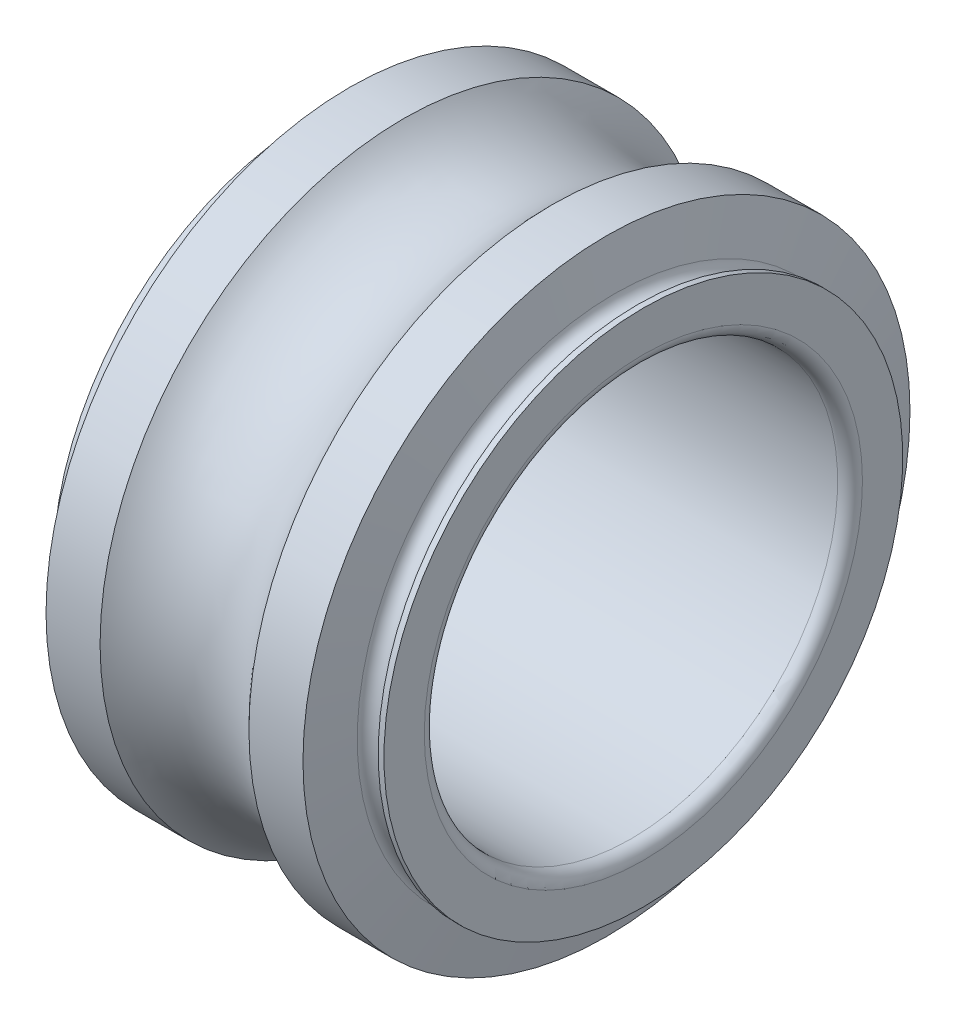
ISO-10303-21;
HEADER;
FILE_DESCRIPTION(('STEP AP214'),'2;1');
FILE_NAME('part.step','',(''),(''),'','','');
FILE_SCHEMA(('AUTOMOTIVE_DESIGN { 1 0 10303 214 1 1 1 1 }'));
ENDSEC;
DATA;
#1=APPLICATION_CONTEXT('core data for automotive mechanical design processes');
#2=APPLICATION_PROTOCOL_DEFINITION('international standard','automotive_design',2000,#1);
#3=PRODUCT_CONTEXT('',#1,'mechanical');
#4=PRODUCT('Part','Part','',(#3));
#5=PRODUCT_RELATED_PRODUCT_CATEGORY('part','',(#4));
#6=PRODUCT_DEFINITION_FORMATION('','',#4);
#7=PRODUCT_DEFINITION_CONTEXT('part definition',#1,'design');
#8=PRODUCT_DEFINITION('design','',#6,#7);
#9=PRODUCT_DEFINITION_SHAPE('','',#8);
#10=(LENGTH_UNIT() NAMED_UNIT(*) SI_UNIT(.MILLI.,.METRE.));
#11=(NAMED_UNIT(*) PLANE_ANGLE_UNIT() SI_UNIT($,.RADIAN.));
#12=(NAMED_UNIT(*) SI_UNIT($,.STERADIAN.) SOLID_ANGLE_UNIT());
#13=UNCERTAINTY_MEASURE_WITH_UNIT(LENGTH_MEASURE(1.E-05),#10,'distance_accuracy_value','');
#14=(GEOMETRIC_REPRESENTATION_CONTEXT(3) GLOBAL_UNCERTAINTY_ASSIGNED_CONTEXT((#13)) GLOBAL_UNIT_ASSIGNED_CONTEXT((#10,
#11,#12)) REPRESENTATION_CONTEXT('',''));
#15=CARTESIAN_POINT('',(0.,0.,0.));
#16=DIRECTION('',(0.,0.,1.));
#17=DIRECTION('',(1.,0.,0.));
#18=AXIS2_PLACEMENT_3D('',#15,#16,#17);
#19=CARTESIAN_POINT('',(6.45393324010605,0.,0.));
#20=DIRECTION('',(-1.,0.,0.));
#21=DIRECTION('',(0.,1.,0.));
#22=AXIS2_PLACEMENT_3D('',#19,#20,#21);
#23=CYLINDRICAL_SURFACE('',#22,7.34175);
#24=CARTESIAN_POINT('',(5.80028273821086,0.,0.));
#25=DIRECTION('',(1.,0.,0.));
#26=DIRECTION('',(0.,1.,0.));
#27=AXIS2_PLACEMENT_3D('',#24,#25,#26);
#28=CIRCLE('',#27,7.34175);
#29=CARTESIAN_POINT('',(5.80028273821086,7.34175,0.));
#30=VERTEX_POINT('',#29);
#31=EDGE_CURVE('E11',#30,#30,#28,.T.);
#32=ORIENTED_EDGE('',*,*,#31,.T.);
#33=EDGE_LOOP('',(#32));
#34=FACE_BOUND('',#33,.T.);
#35=CARTESIAN_POINT('',(7.10758374200124,0.,0.));
#36=DIRECTION('',(1.,0.,0.));
#37=DIRECTION('',(0.,1.,0.));
#38=AXIS2_PLACEMENT_3D('',#35,#36,#37);
#39=CIRCLE('',#38,7.34175);
#40=CARTESIAN_POINT('',(7.10758374200124,7.34175,0.));
#41=VERTEX_POINT('',#40);
#42=EDGE_CURVE('E99',#41,#41,#39,.T.);
#43=ORIENTED_EDGE('',*,*,#42,.F.);
#44=EDGE_LOOP('',(#43));
#45=FACE_BOUND('',#44,.T.);
#46=ADVANCED_FACE('F16',(#34,#45),#23,.T.);
#47=CARTESIAN_POINT('',(4.,0.,0.));
#48=DIRECTION('',(1.,0.,0.));
#49=DIRECTION('',(0.,0.,-1.));
#50=AXIS2_PLACEMENT_3D('',#47,#48,#49);
#51=TOROIDAL_SURFACE('',#50,8.9,2.381);
#52=CARTESIAN_POINT('',(2.19971726178914,0.,0.));
#53=DIRECTION('',(1.,0.,0.));
#54=DIRECTION('',(0.,1.,0.));
#55=AXIS2_PLACEMENT_3D('',#52,#53,#54);
#56=CIRCLE('',#55,7.34175);
#57=CARTESIAN_POINT('',(2.19971726178914,7.34175,0.));
#58=VERTEX_POINT('',#57);
#59=EDGE_CURVE('E26',#58,#58,#56,.T.);
#60=ORIENTED_EDGE('',*,*,#59,.T.);
#61=EDGE_LOOP('',(#60));
#62=FACE_BOUND('',#61,.T.);
#63=ORIENTED_EDGE('',*,*,#31,.F.);
#64=EDGE_LOOP('',(#63));
#65=FACE_BOUND('',#64,.T.);
#66=ADVANCED_FACE('F108',(#62,#65),#51,.F.);
#67=CARTESIAN_POINT('',(1.54606675989395,0.,0.));
#68=DIRECTION('',(-1.,0.,0.));
#69=DIRECTION('',(0.,1.,0.));
#70=AXIS2_PLACEMENT_3D('',#67,#68,#69);
#71=CYLINDRICAL_SURFACE('',#70,7.34175);
#72=CARTESIAN_POINT('',(0.892416257998765,0.,0.));
#73=DIRECTION('',(1.,0.,0.));
#74=DIRECTION('',(0.,1.,0.));
#75=AXIS2_PLACEMENT_3D('',#72,#73,#74);
#76=CIRCLE('',#75,7.34175);
#77=CARTESIAN_POINT('',(0.892416257998765,7.34175,0.));
#78=VERTEX_POINT('',#77);
#79=EDGE_CURVE('E46',#78,#78,#76,.T.);
#80=ORIENTED_EDGE('',*,*,#79,.T.);
#81=EDGE_LOOP('',(#80));
#82=FACE_BOUND('',#81,.T.);
#83=ORIENTED_EDGE('',*,*,#59,.F.);
#84=EDGE_LOOP('',(#83));
#85=FACE_BOUND('',#84,.T.);
#86=ADVANCED_FACE('F114',(#82,#85),#71,.T.);
#87=CARTESIAN_POINT('',(0.794081214421092,0.,0.));
#88=DIRECTION('',(1.,0.,0.));
#89=DIRECTION('',(0.,1.,0.));
#90=AXIS2_PLACEMENT_3D('',#87,#88,#89);
#91=CONICAL_SURFACE('',#90,6.78406425512663,1.39626340159546);
#92=CARTESIAN_POINT('',(0.695746170843419,0.,0.));
#93=DIRECTION('',(1.,0.,0.));
#94=DIRECTION('',(0.,1.,0.));
#95=AXIS2_PLACEMENT_3D('',#92,#93,#94);
#96=CIRCLE('',#95,6.22637851025326);
#97=CARTESIAN_POINT('',(0.695746170843419,6.22637851025326,0.));
#98=VERTEX_POINT('',#97);
#99=EDGE_CURVE('E50',#98,#98,#96,.T.);
#100=ORIENTED_EDGE('',*,*,#99,.T.);
#101=EDGE_LOOP('',(#100));
#102=FACE_BOUND('',#101,.T.);
#103=ORIENTED_EDGE('',*,*,#79,.F.);
#104=EDGE_LOOP('',(#103));
#105=FACE_BOUND('',#104,.T.);
#106=ADVANCED_FACE('F125',(#102,#105),#91,.T.);
#107=CARTESIAN_POINT('',(0.42,0.,0.));
#108=DIRECTION('',(1.,0.,0.));
#109=DIRECTION('',(0.,0.,-1.));
#110=AXIS2_PLACEMENT_3D('',#107,#108,#109);
#111=TOROIDAL_SURFACE('',#110,6.275,0.28);
#112=CARTESIAN_POINT('',(0.14,0.,0.));
#113=DIRECTION('',(1.,0.,0.));
#114=DIRECTION('',(0.,1.,0.));
#115=AXIS2_PLACEMENT_3D('',#112,#113,#114);
#116=CIRCLE('',#115,6.275);
#117=CARTESIAN_POINT('',(0.14,6.275,0.));
#118=VERTEX_POINT('',#117);
#119=EDGE_CURVE('E90',#118,#118,#116,.T.);
#120=ORIENTED_EDGE('',*,*,#119,.T.);
#121=EDGE_LOOP('',(#120));
#122=FACE_BOUND('',#121,.T.);
#123=ORIENTED_EDGE('',*,*,#99,.F.);
#124=EDGE_LOOP('',(#123));
#125=FACE_BOUND('',#124,.T.);
#126=ADVANCED_FACE('F18',(#122,#125),#111,.F.);
#127=CARTESIAN_POINT('',(0.07,0.,0.));
#128=DIRECTION('',(-1.,0.,0.));
#129=DIRECTION('',(0.,1.,0.));
#130=AXIS2_PLACEMENT_3D('',#127,#128,#129);
#131=CYLINDRICAL_SURFACE('',#130,6.275);
#132=CARTESIAN_POINT('',(0.,0.,0.));
#133=DIRECTION('',(1.,0.,0.));
#134=DIRECTION('',(0.,1.,0.));
#135=AXIS2_PLACEMENT_3D('',#132,#133,#134);
#136=CIRCLE('',#135,6.275);
#137=CARTESIAN_POINT('',(0.,6.275,0.));
#138=VERTEX_POINT('',#137);
#139=EDGE_CURVE('E20',#138,#138,#136,.T.);
#140=ORIENTED_EDGE('',*,*,#139,.T.);
#141=EDGE_LOOP('',(#140));
#142=FACE_BOUND('',#141,.T.);
#143=ORIENTED_EDGE('',*,*,#119,.F.);
#144=EDGE_LOOP('',(#143));
#145=FACE_BOUND('',#144,.T.);
#146=ADVANCED_FACE('F118',(#142,#145),#131,.T.);
#147=CARTESIAN_POINT('',(0.,5.7875,0.));
#148=DIRECTION('',(-1.,0.,0.));
#149=DIRECTION('',(0.,-1.,0.));
#150=AXIS2_PLACEMENT_3D('',#147,#148,#149);
#151=PLANE('',#150);
#152=CARTESIAN_POINT('',(0.,0.,0.));
#153=DIRECTION('',(1.,0.,0.));
#154=DIRECTION('',(0.,1.,0.));
#155=AXIS2_PLACEMENT_3D('',#152,#153,#154);
#156=CIRCLE('',#155,5.3);
#157=CARTESIAN_POINT('',(0.,5.3,0.));
#158=VERTEX_POINT('',#157);
#159=EDGE_CURVE('E84',#158,#158,#156,.T.);
#160=ORIENTED_EDGE('',*,*,#159,.T.);
#161=EDGE_LOOP('',(#160));
#162=FACE_BOUND('',#161,.T.);
#163=ORIENTED_EDGE('',*,*,#139,.F.);
#164=EDGE_LOOP('',(#163));
#165=FACE_BOUND('',#164,.T.);
#166=ADVANCED_FACE('F139',(#162,#165),#151,.T.);
#167=CARTESIAN_POINT('',(0.3,0.,0.));
#168=DIRECTION('',(1.,0.,0.));
#169=DIRECTION('',(0.,0.,-1.));
#170=AXIS2_PLACEMENT_3D('',#167,#168,#169);
#171=TOROIDAL_SURFACE('',#170,5.3,0.3);
#172=CARTESIAN_POINT('',(0.3,0.,0.));
#173=DIRECTION('',(1.,0.,0.));
#174=DIRECTION('',(0.,1.,0.));
#175=AXIS2_PLACEMENT_3D('',#172,#173,#174);
#176=CIRCLE('',#175,5.);
#177=CARTESIAN_POINT('',(0.3,5.,0.));
#178=VERTEX_POINT('',#177);
#179=EDGE_CURVE('E82',#178,#178,#176,.T.);
#180=ORIENTED_EDGE('',*,*,#179,.T.);
#181=EDGE_LOOP('',(#180));
#182=FACE_BOUND('',#181,.T.);
#183=ORIENTED_EDGE('',*,*,#159,.F.);
#184=EDGE_LOOP('',(#183));
#185=FACE_BOUND('',#184,.T.);
#186=ADVANCED_FACE('F145',(#182,#185),#171,.T.);
#187=CARTESIAN_POINT('',(4.,0.,0.));
#188=DIRECTION('',(-1.,0.,0.));
#189=DIRECTION('',(0.,1.,0.));
#190=AXIS2_PLACEMENT_3D('',#187,#188,#189);
#191=CYLINDRICAL_SURFACE('',#190,5.);
#192=CARTESIAN_POINT('',(7.7,0.,0.));
#193=DIRECTION('',(1.,0.,0.));
#194=DIRECTION('',(0.,1.,0.));
#195=AXIS2_PLACEMENT_3D('',#192,#193,#194);
#196=CIRCLE('',#195,5.);
#197=CARTESIAN_POINT('',(7.7,5.,0.));
#198=VERTEX_POINT('',#197);
#199=EDGE_CURVE('E78',#198,#198,#196,.T.);
#200=ORIENTED_EDGE('',*,*,#199,.T.);
#201=EDGE_LOOP('',(#200));
#202=FACE_BOUND('',#201,.T.);
#203=ORIENTED_EDGE('',*,*,#179,.F.);
#204=EDGE_LOOP('',(#203));
#205=FACE_BOUND('',#204,.T.);
#206=ADVANCED_FACE('F79',(#202,#205),#191,.F.);
#207=CARTESIAN_POINT('',(7.7,0.,0.));
#208=DIRECTION('',(1.,0.,0.));
#209=DIRECTION('',(0.,0.,-1.));
#210=AXIS2_PLACEMENT_3D('',#207,#208,#209);
#211=TOROIDAL_SURFACE('',#210,5.3,0.3);
#212=CARTESIAN_POINT('',(8.,0.,0.));
#213=DIRECTION('',(1.,0.,0.));
#214=DIRECTION('',(0.,1.,0.));
#215=AXIS2_PLACEMENT_3D('',#212,#213,#214);
#216=CIRCLE('',#215,5.3);
#217=CARTESIAN_POINT('',(8.,5.3,0.));
#218=VERTEX_POINT('',#217);
#219=EDGE_CURVE('E74',#218,#218,#216,.T.);
#220=ORIENTED_EDGE('',*,*,#219,.T.);
#221=EDGE_LOOP('',(#220));
#222=FACE_BOUND('',#221,.T.);
#223=ORIENTED_EDGE('',*,*,#199,.F.);
#224=EDGE_LOOP('',(#223));
#225=FACE_BOUND('',#224,.T.);
#226=ADVANCED_FACE('F121',(#222,#225),#211,.T.);
#227=CARTESIAN_POINT('',(8.,5.7875,0.));
#228=DIRECTION('',(1.,0.,0.));
#229=DIRECTION('',(0.,1.,0.));
#230=AXIS2_PLACEMENT_3D('',#227,#228,#229);
#231=PLANE('',#230);
#232=CARTESIAN_POINT('',(8.,0.,0.));
#233=DIRECTION('',(1.,0.,0.));
#234=DIRECTION('',(0.,1.,0.));
#235=AXIS2_PLACEMENT_3D('',#232,#233,#234);
#236=CIRCLE('',#235,6.275);
#237=CARTESIAN_POINT('',(8.,6.275,0.));
#238=VERTEX_POINT('',#237);
#239=EDGE_CURVE('E86',#238,#238,#236,.T.);
#240=ORIENTED_EDGE('',*,*,#239,.T.);
#241=EDGE_LOOP('',(#240));
#242=FACE_BOUND('',#241,.T.);
#243=ORIENTED_EDGE('',*,*,#219,.F.);
#244=EDGE_LOOP('',(#243));
#245=FACE_BOUND('',#244,.T.);
#246=ADVANCED_FACE('F123',(#242,#245),#231,.T.);
#247=CARTESIAN_POINT('',(7.93,0.,0.));
#248=DIRECTION('',(-1.,0.,0.));
#249=DIRECTION('',(0.,1.,0.));
#250=AXIS2_PLACEMENT_3D('',#247,#248,#249);
#251=CYLINDRICAL_SURFACE('',#250,6.275);
#252=CARTESIAN_POINT('',(7.86,0.,0.));
#253=DIRECTION('',(1.,0.,0.));
#254=DIRECTION('',(0.,1.,0.));
#255=AXIS2_PLACEMENT_3D('',#252,#253,#254);
#256=CIRCLE('',#255,6.275);
#257=CARTESIAN_POINT('',(7.86,6.275,0.));
#258=VERTEX_POINT('',#257);
#259=EDGE_CURVE('E98',#258,#258,#256,.T.);
#260=ORIENTED_EDGE('',*,*,#259,.T.);
#261=EDGE_LOOP('',(#260));
#262=FACE_BOUND('',#261,.T.);
#263=ORIENTED_EDGE('',*,*,#239,.F.);
#264=EDGE_LOOP('',(#263));
#265=FACE_BOUND('',#264,.T.);
#266=ADVANCED_FACE('F141',(#262,#265),#251,.T.);
#267=CARTESIAN_POINT('',(7.58,0.,0.));
#268=DIRECTION('',(1.,0.,0.));
#269=DIRECTION('',(0.,0.,-1.));
#270=AXIS2_PLACEMENT_3D('',#267,#268,#269);
#271=TOROIDAL_SURFACE('',#270,6.275,0.28);
#272=CARTESIAN_POINT('',(7.30425382915658,0.,0.));
#273=DIRECTION('',(1.,0.,0.));
#274=DIRECTION('',(0.,1.,0.));
#275=AXIS2_PLACEMENT_3D('',#272,#273,#274);
#276=CIRCLE('',#275,6.22637851025326);
#277=CARTESIAN_POINT('',(7.30425382915658,6.22637851025326,0.));
#278=VERTEX_POINT('',#277);
#279=EDGE_CURVE('E101',#278,#278,#276,.T.);
#280=ORIENTED_EDGE('',*,*,#279,.T.);
#281=EDGE_LOOP('',(#280));
#282=FACE_BOUND('',#281,.T.);
#283=ORIENTED_EDGE('',*,*,#259,.F.);
#284=EDGE_LOOP('',(#283));
#285=FACE_BOUND('',#284,.T.);
#286=ADVANCED_FACE('F143',(#282,#285),#271,.F.);
#287=CARTESIAN_POINT('',(7.20591878557891,0.,0.));
#288=DIRECTION('',(-1.,0.,0.));
#289=DIRECTION('',(0.,1.,0.));
#290=AXIS2_PLACEMENT_3D('',#287,#288,#289);
#291=CONICAL_SURFACE('',#290,6.78406425512663,1.39626340159546);
#292=ORIENTED_EDGE('',*,*,#42,.T.);
#293=EDGE_LOOP('',(#292));
#294=FACE_BOUND('',#293,.T.);
#295=ORIENTED_EDGE('',*,*,#279,.F.);
#296=EDGE_LOOP('',(#295));
#297=FACE_BOUND('',#296,.T.);
#298=ADVANCED_FACE('F104',(#294,#297),#291,.T.);
#299=CLOSED_SHELL('',(#46,#66,#86,#106,#126,#146,#166,#186,#206,#226,#246,#266,#286,#298));
#300=MANIFOLD_SOLID_BREP('B1',#299);
#301=ADVANCED_BREP_SHAPE_REPRESENTATION('',(#18,#300),#14);
#302=SHAPE_DEFINITION_REPRESENTATION(#9,#301);
ENDSEC;
END-ISO-10303-21;
